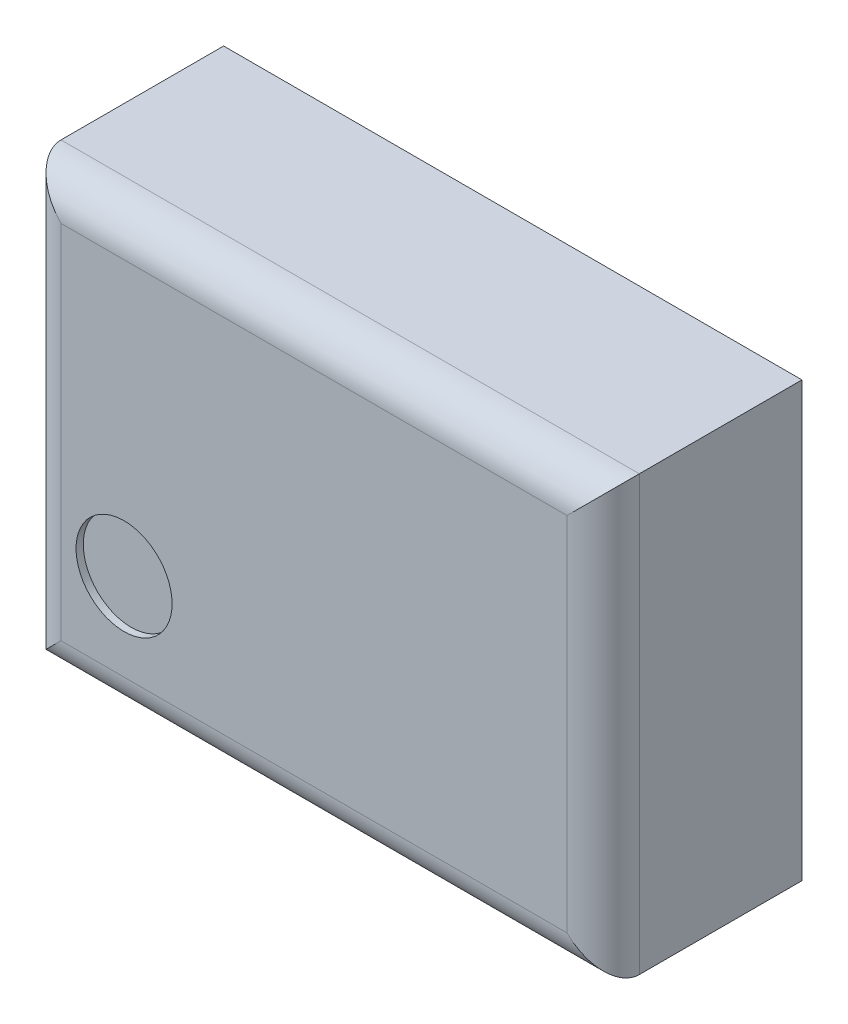
ISO-10303-21;
HEADER;
FILE_DESCRIPTION(('STEP AP214'),'2;1');
FILE_NAME('part.step','',(''),(''),'','','');
FILE_SCHEMA(('AUTOMOTIVE_DESIGN { 1 0 10303 214 1 1 1 1 }'));
ENDSEC;
DATA;
#1=APPLICATION_CONTEXT('core data for automotive mechanical design processes');
#2=APPLICATION_PROTOCOL_DEFINITION('international standard','automotive_design',2000,#1);
#3=PRODUCT_CONTEXT('',#1,'mechanical');
#4=PRODUCT('Part','Part','',(#3));
#5=PRODUCT_RELATED_PRODUCT_CATEGORY('part','',(#4));
#6=PRODUCT_DEFINITION_FORMATION('','',#4);
#7=PRODUCT_DEFINITION_CONTEXT('part definition',#1,'design');
#8=PRODUCT_DEFINITION('design','',#6,#7);
#9=PRODUCT_DEFINITION_SHAPE('','',#8);
#10=(LENGTH_UNIT() NAMED_UNIT(*) SI_UNIT(.MILLI.,.METRE.));
#11=(NAMED_UNIT(*) PLANE_ANGLE_UNIT() SI_UNIT($,.RADIAN.));
#12=(NAMED_UNIT(*) SI_UNIT($,.STERADIAN.) SOLID_ANGLE_UNIT());
#13=UNCERTAINTY_MEASURE_WITH_UNIT(LENGTH_MEASURE(1.E-05),#10,'distance_accuracy_value','');
#14=(GEOMETRIC_REPRESENTATION_CONTEXT(3) GLOBAL_UNCERTAINTY_ASSIGNED_CONTEXT((#13)) GLOBAL_UNIT_ASSIGNED_CONTEXT((#10,
#11,#12)) REPRESENTATION_CONTEXT('',''));
#15=CARTESIAN_POINT('',(0.,0.,0.));
#16=DIRECTION('',(0.,0.,1.));
#17=DIRECTION('',(1.,0.,0.));
#18=AXIS2_PLACEMENT_3D('',#15,#16,#17);
#19=CARTESIAN_POINT('',(0.,0.,0.05));
#20=DIRECTION('',(0.,0.,-1.));
#21=DIRECTION('',(-1.,0.,0.));
#22=AXIS2_PLACEMENT_3D('',#19,#20,#21);
#23=PLANE('',#22);
#24=DIRECTION('',(0.,1.,0.));
#25=VECTOR('',#24,1.);
#26=CARTESIAN_POINT('',(0.8,-0.6,0.05));
#27=LINE('',#26,#25);
#28=CARTESIAN_POINT('',(0.8,-0.6,0.05));
#29=VERTEX_POINT('',#28);
#30=CARTESIAN_POINT('',(0.8,0.6,0.05));
#31=VERTEX_POINT('',#30);
#32=EDGE_CURVE('E375',#29,#31,#27,.T.);
#33=ORIENTED_EDGE('',*,*,#32,.F.);
#34=DIRECTION('',(1.,0.,0.));
#35=VECTOR('',#34,1.);
#36=CARTESIAN_POINT('',(-0.8,-0.6,0.05));
#37=LINE('',#36,#35);
#38=CARTESIAN_POINT('',(-0.8,-0.6,0.05));
#39=VERTEX_POINT('',#38);
#40=EDGE_CURVE('E387',#39,#29,#37,.T.);
#41=ORIENTED_EDGE('',*,*,#40,.F.);
#42=DIRECTION('',(0.,-1.,0.));
#43=VECTOR('',#42,1.);
#44=CARTESIAN_POINT('',(-0.8,-0.6,0.05));
#45=LINE('',#44,#43);
#46=CARTESIAN_POINT('',(-0.8,0.6,0.05));
#47=VERTEX_POINT('',#46);
#48=EDGE_CURVE('E383',#47,#39,#45,.T.);
#49=ORIENTED_EDGE('',*,*,#48,.F.);
#50=DIRECTION('',(-1.,0.,0.));
#51=VECTOR('',#50,1.);
#52=CARTESIAN_POINT('',(-0.8,0.6,0.05));
#53=LINE('',#52,#51);
#54=EDGE_CURVE('E379',#31,#47,#53,.T.);
#55=ORIENTED_EDGE('',*,*,#54,.F.);
#56=EDGE_LOOP('',(#33,#41,#49,#55));
#57=FACE_BOUND('',#56,.T.);
#58=DIRECTION('',(0.,1.,0.));
#59=VECTOR('',#58,1.);
#60=CARTESIAN_POINT('',(-0.75,-0.55,0.05));
#61=LINE('',#60,#59);
#62=CARTESIAN_POINT('',(-0.75,-0.55,0.05));
#63=VERTEX_POINT('',#62);
#64=CARTESIAN_POINT('',(-0.75,-0.15,0.05));
#65=VERTEX_POINT('',#64);
#66=EDGE_CURVE('E371',#63,#65,#61,.T.);
#67=ORIENTED_EDGE('',*,*,#66,.F.);
#68=DIRECTION('',(-1.,0.,0.));
#69=VECTOR('',#68,1.);
#70=CARTESIAN_POINT('',(-0.75,-0.55,0.05));
#71=LINE('',#70,#69);
#72=CARTESIAN_POINT('',(-0.25,-0.55,0.05));
#73=VERTEX_POINT('',#72);
#74=EDGE_CURVE('E368',#73,#63,#71,.T.);
#75=ORIENTED_EDGE('',*,*,#74,.F.);
#76=DIRECTION('',(0.,-1.,0.));
#77=VECTOR('',#76,1.);
#78=CARTESIAN_POINT('',(-0.25,-0.55,0.05));
#79=LINE('',#78,#77);
#80=CARTESIAN_POINT('',(-0.25,-0.15,0.05));
#81=VERTEX_POINT('',#80);
#82=EDGE_CURVE('E365',#81,#73,#79,.T.);
#83=ORIENTED_EDGE('',*,*,#82,.F.);
#84=DIRECTION('',(1.,0.,0.));
#85=VECTOR('',#84,1.);
#86=CARTESIAN_POINT('',(-0.75,-0.15,0.05));
#87=LINE('',#86,#85);
#88=EDGE_CURVE('E362',#65,#81,#87,.T.);
#89=ORIENTED_EDGE('',*,*,#88,.F.);
#90=EDGE_LOOP('',(#67,#75,#83,#89));
#91=FACE_BOUND('',#90,.T.);
#92=DIRECTION('',(0.,1.,0.));
#93=VECTOR('',#92,1.);
#94=CARTESIAN_POINT('',(-0.75,0.15,0.05));
#95=LINE('',#94,#93);
#96=CARTESIAN_POINT('',(-0.75,0.15,0.05));
#97=VERTEX_POINT('',#96);
#98=CARTESIAN_POINT('',(-0.75,0.55,0.05));
#99=VERTEX_POINT('',#98);
#100=EDGE_CURVE('E282',#97,#99,#95,.T.);
#101=ORIENTED_EDGE('',*,*,#100,.F.);
#102=DIRECTION('',(-1.,0.,0.));
#103=VECTOR('',#102,1.);
#104=CARTESIAN_POINT('',(-0.75,0.15,0.05));
#105=LINE('',#104,#103);
#106=CARTESIAN_POINT('',(-0.25,0.15,0.05));
#107=VERTEX_POINT('',#106);
#108=EDGE_CURVE('E297',#107,#97,#105,.T.);
#109=ORIENTED_EDGE('',*,*,#108,.F.);
#110=DIRECTION('',(0.,-1.,0.));
#111=VECTOR('',#110,1.);
#112=CARTESIAN_POINT('',(-0.25,0.15,0.05));
#113=LINE('',#112,#111);
#114=CARTESIAN_POINT('',(-0.25,0.55,0.05));
#115=VERTEX_POINT('',#114);
#116=EDGE_CURVE('E300',#115,#107,#113,.T.);
#117=ORIENTED_EDGE('',*,*,#116,.F.);
#118=DIRECTION('',(1.,0.,0.));
#119=VECTOR('',#118,1.);
#120=CARTESIAN_POINT('',(-0.75,0.55,0.05));
#121=LINE('',#120,#119);
#122=EDGE_CURVE('E303',#99,#115,#121,.T.);
#123=ORIENTED_EDGE('',*,*,#122,.F.);
#124=EDGE_LOOP('',(#101,#109,#117,#123));
#125=FACE_BOUND('',#124,.T.);
#126=DIRECTION('',(0.,1.,0.));
#127=VECTOR('',#126,1.);
#128=CARTESIAN_POINT('',(0.25,0.15,0.05));
#129=LINE('',#128,#127);
#130=CARTESIAN_POINT('',(0.25,0.15,0.05));
#131=VERTEX_POINT('',#130);
#132=CARTESIAN_POINT('',(0.25,0.55,0.05));
#133=VERTEX_POINT('',#132);
#134=EDGE_CURVE('E242',#131,#133,#129,.T.);
#135=ORIENTED_EDGE('',*,*,#134,.F.);
#136=DIRECTION('',(-1.,0.,0.));
#137=VECTOR('',#136,1.);
#138=CARTESIAN_POINT('',(0.25,0.15,0.05));
#139=LINE('',#138,#137);
#140=CARTESIAN_POINT('',(0.75,0.15,0.05));
#141=VERTEX_POINT('',#140);
#142=EDGE_CURVE('E256',#141,#131,#139,.T.);
#143=ORIENTED_EDGE('',*,*,#142,.F.);
#144=DIRECTION('',(0.,-1.,0.));
#145=VECTOR('',#144,1.);
#146=CARTESIAN_POINT('',(0.75,0.15,0.05));
#147=LINE('',#146,#145);
#148=CARTESIAN_POINT('',(0.75,0.55,0.05));
#149=VERTEX_POINT('',#148);
#150=EDGE_CURVE('E259',#149,#141,#147,.T.);
#151=ORIENTED_EDGE('',*,*,#150,.F.);
#152=DIRECTION('',(1.,0.,0.));
#153=VECTOR('',#152,1.);
#154=CARTESIAN_POINT('',(0.25,0.55,0.05));
#155=LINE('',#154,#153);
#156=EDGE_CURVE('E262',#133,#149,#155,.T.);
#157=ORIENTED_EDGE('',*,*,#156,.F.);
#158=EDGE_LOOP('',(#135,#143,#151,#157));
#159=FACE_BOUND('',#158,.T.);
#160=DIRECTION('',(0.,1.,0.));
#161=VECTOR('',#160,1.);
#162=CARTESIAN_POINT('',(0.25,-0.55,0.05));
#163=LINE('',#162,#161);
#164=CARTESIAN_POINT('',(0.25,-0.55,0.05));
#165=VERTEX_POINT('',#164);
#166=CARTESIAN_POINT('',(0.25,-0.15,0.05));
#167=VERTEX_POINT('',#166);
#168=EDGE_CURVE('E206',#165,#167,#163,.T.);
#169=ORIENTED_EDGE('',*,*,#168,.F.);
#170=DIRECTION('',(-1.,0.,0.));
#171=VECTOR('',#170,1.);
#172=CARTESIAN_POINT('',(0.25,-0.55,0.05));
#173=LINE('',#172,#171);
#174=CARTESIAN_POINT('',(0.75,-0.55,0.05));
#175=VERTEX_POINT('',#174);
#176=EDGE_CURVE('E194',#175,#165,#173,.T.);
#177=ORIENTED_EDGE('',*,*,#176,.F.);
#178=DIRECTION('',(0.,-1.,0.));
#179=VECTOR('',#178,1.);
#180=CARTESIAN_POINT('',(0.75,-0.55,0.05));
#181=LINE('',#180,#179);
#182=CARTESIAN_POINT('',(0.75,-0.15,0.05));
#183=VERTEX_POINT('',#182);
#184=EDGE_CURVE('E205',#183,#175,#181,.T.);
#185=ORIENTED_EDGE('',*,*,#184,.F.);
#186=DIRECTION('',(1.,0.,0.));
#187=VECTOR('',#186,1.);
#188=CARTESIAN_POINT('',(0.25,-0.15,0.05));
#189=LINE('',#188,#187);
#190=EDGE_CURVE('E216',#167,#183,#189,.T.);
#191=ORIENTED_EDGE('',*,*,#190,.F.);
#192=EDGE_LOOP('',(#169,#177,#185,#191));
#193=FACE_BOUND('',#192,.T.);
#194=ADVANCED_FACE('F43',(#57,#91,#125,#159,#193),#23,.T.);
#195=CARTESIAN_POINT('',(0.8,-0.6,0.6));
#196=DIRECTION('',(-1.,0.,0.));
#197=DIRECTION('',(0.,0.,1.));
#198=AXIS2_PLACEMENT_3D('',#195,#196,#197);
#199=PLANE('',#198);
#200=DIRECTION('',(0.,0.,-1.));
#201=VECTOR('',#200,1.);
#202=CARTESIAN_POINT('',(0.8,0.6,0.6));
#203=LINE('',#202,#201);
#204=CARTESIAN_POINT('',(0.8,0.6,0.5));
#205=VERTEX_POINT('',#204);
#206=EDGE_CURVE('E400',#205,#31,#203,.T.);
#207=ORIENTED_EDGE('',*,*,#206,.F.);
#208=DIRECTION('',(0.,1.,0.));
#209=VECTOR('',#208,1.);
#210=CARTESIAN_POINT('',(0.8,-0.6,0.5));
#211=LINE('',#210,#209);
#212=CARTESIAN_POINT('',(0.8,-0.6,0.5));
#213=VERTEX_POINT('',#212);
#214=EDGE_CURVE('E11',#205,#213,#211,.F.);
#215=ORIENTED_EDGE('',*,*,#214,.T.);
#216=DIRECTION('',(0.,0.,-1.));
#217=VECTOR('',#216,1.);
#218=CARTESIAN_POINT('',(0.8,-0.6,0.6));
#219=LINE('',#218,#217);
#220=EDGE_CURVE('E391',#213,#29,#219,.T.);
#221=ORIENTED_EDGE('',*,*,#220,.T.);
#222=ORIENTED_EDGE('',*,*,#32,.T.);
#223=EDGE_LOOP('',(#207,#215,#221,#222));
#224=FACE_BOUND('',#223,.T.);
#225=ADVANCED_FACE('F460',(#224),#199,.F.);
#226=CARTESIAN_POINT('',(-0.8,0.6,0.6));
#227=DIRECTION('',(0.,-1.,0.));
#228=DIRECTION('',(0.,0.,-1.));
#229=AXIS2_PLACEMENT_3D('',#226,#227,#228);
#230=PLANE('',#229);
#231=DIRECTION('',(0.,0.,-1.));
#232=VECTOR('',#231,1.);
#233=CARTESIAN_POINT('',(-0.8,0.6,0.6));
#234=LINE('',#233,#232);
#235=CARTESIAN_POINT('',(-0.8,0.6,0.5));
#236=VERTEX_POINT('',#235);
#237=EDGE_CURVE('E397',#236,#47,#234,.T.);
#238=ORIENTED_EDGE('',*,*,#237,.F.);
#239=DIRECTION('',(-1.,0.,0.));
#240=VECTOR('',#239,1.);
#241=CARTESIAN_POINT('',(-0.8,0.6,0.5));
#242=LINE('',#241,#240);
#243=EDGE_CURVE('E53',#236,#205,#242,.F.);
#244=ORIENTED_EDGE('',*,*,#243,.T.);
#245=ORIENTED_EDGE('',*,*,#206,.T.);
#246=ORIENTED_EDGE('',*,*,#54,.T.);
#247=EDGE_LOOP('',(#238,#244,#245,#246));
#248=FACE_BOUND('',#247,.T.);
#249=ADVANCED_FACE('F461',(#248),#230,.F.);
#250=CARTESIAN_POINT('',(-0.8,-0.6,0.6));
#251=DIRECTION('',(1.,0.,0.));
#252=DIRECTION('',(0.,0.,-1.));
#253=AXIS2_PLACEMENT_3D('',#250,#251,#252);
#254=PLANE('',#253);
#255=DIRECTION('',(0.,0.,-1.));
#256=VECTOR('',#255,1.);
#257=CARTESIAN_POINT('',(-0.8,-0.6,0.6));
#258=LINE('',#257,#256);
#259=CARTESIAN_POINT('',(-0.8,-0.6,0.5));
#260=VERTEX_POINT('',#259);
#261=EDGE_CURVE('E394',#260,#39,#258,.T.);
#262=ORIENTED_EDGE('',*,*,#261,.F.);
#263=DIRECTION('',(0.,-1.,0.));
#264=VECTOR('',#263,1.);
#265=CARTESIAN_POINT('',(-0.8,-0.6,0.5));
#266=LINE('',#265,#264);
#267=EDGE_CURVE('E68',#260,#236,#266,.F.);
#268=ORIENTED_EDGE('',*,*,#267,.T.);
#269=ORIENTED_EDGE('',*,*,#237,.T.);
#270=ORIENTED_EDGE('',*,*,#48,.T.);
#271=EDGE_LOOP('',(#262,#268,#269,#270));
#272=FACE_BOUND('',#271,.T.);
#273=ADVANCED_FACE('F452',(#272),#254,.F.);
#274=CARTESIAN_POINT('',(-0.8,-0.6,0.6));
#275=DIRECTION('',(0.,1.,0.));
#276=DIRECTION('',(0.,0.,1.));
#277=AXIS2_PLACEMENT_3D('',#274,#275,#276);
#278=PLANE('',#277);
#279=ORIENTED_EDGE('',*,*,#220,.F.);
#280=DIRECTION('',(1.,0.,0.));
#281=VECTOR('',#280,1.);
#282=CARTESIAN_POINT('',(-0.8,-0.6,0.5));
#283=LINE('',#282,#281);
#284=EDGE_CURVE('E416',#213,#260,#283,.F.);
#285=ORIENTED_EDGE('',*,*,#284,.T.);
#286=ORIENTED_EDGE('',*,*,#261,.T.);
#287=ORIENTED_EDGE('',*,*,#40,.T.);
#288=EDGE_LOOP('',(#279,#285,#286,#287));
#289=FACE_BOUND('',#288,.T.);
#290=ADVANCED_FACE('F451',(#289),#278,.F.);
#291=CARTESIAN_POINT('',(0.,0.,0.6));
#292=DIRECTION('',(0.,0.,-1.));
#293=DIRECTION('',(-1.,0.,0.));
#294=AXIS2_PLACEMENT_3D('',#291,#292,#293);
#295=PLANE('',#294);
#296=CARTESIAN_POINT('',(-0.525466390564944,-0.258003208926993,0.6));
#297=DIRECTION('',(0.,0.,1.));
#298=DIRECTION('',(1.,0.,0.));
#299=AXIS2_PLACEMENT_3D('',#296,#297,#298);
#300=CIRCLE('',#299,0.132827506627821);
#301=CARTESIAN_POINT('',(-0.392638883937123,-0.258003208926993,0.6));
#302=VERTEX_POINT('',#301);
#303=EDGE_CURVE('E224',#302,#302,#300,.T.);
#304=ORIENTED_EDGE('',*,*,#303,.F.);
#305=EDGE_LOOP('',(#304));
#306=FACE_BOUND('',#305,.T.);
#307=DIRECTION('',(0.,-1.,0.));
#308=VECTOR('',#307,1.);
#309=CARTESIAN_POINT('',(-0.7,0.,0.6));
#310=LINE('',#309,#308);
#311=CARTESIAN_POINT('',(-0.7,0.5,0.6));
#312=VERTEX_POINT('',#311);
#313=CARTESIAN_POINT('',(-0.7,-0.5,0.6));
#314=VERTEX_POINT('',#313);
#315=EDGE_CURVE('E409',#312,#314,#310,.T.);
#316=ORIENTED_EDGE('',*,*,#315,.T.);
#317=DIRECTION('',(1.,0.,0.));
#318=VECTOR('',#317,1.);
#319=CARTESIAN_POINT('',(0.,-0.5,0.6));
#320=LINE('',#319,#318);
#321=CARTESIAN_POINT('',(0.7,-0.5,0.6));
#322=VERTEX_POINT('',#321);
#323=EDGE_CURVE('E412',#314,#322,#320,.T.);
#324=ORIENTED_EDGE('',*,*,#323,.T.);
#325=DIRECTION('',(0.,1.,0.));
#326=VECTOR('',#325,1.);
#327=CARTESIAN_POINT('',(0.7,0.,0.6));
#328=LINE('',#327,#326);
#329=CARTESIAN_POINT('',(0.7,0.5,0.6));
#330=VERTEX_POINT('',#329);
#331=EDGE_CURVE('E403',#322,#330,#328,.T.);
#332=ORIENTED_EDGE('',*,*,#331,.T.);
#333=DIRECTION('',(-1.,0.,0.));
#334=VECTOR('',#333,1.);
#335=CARTESIAN_POINT('',(0.,0.5,0.6));
#336=LINE('',#335,#334);
#337=EDGE_CURVE('E406',#330,#312,#336,.T.);
#338=ORIENTED_EDGE('',*,*,#337,.T.);
#339=EDGE_LOOP('',(#316,#324,#332,#338));
#340=FACE_BOUND('',#339,.T.);
#341=ADVANCED_FACE('F443',(#306,#340),#295,.F.);
#342=CARTESIAN_POINT('',(-0.75,-0.55,0.602));
#343=DIRECTION('',(0.,1.,0.));
#344=DIRECTION('',(0.,0.,1.));
#345=AXIS2_PLACEMENT_3D('',#342,#343,#344);
#346=PLANE('',#345);
#347=DIRECTION('',(0.,0.,-1.));
#348=VECTOR('',#347,1.);
#349=CARTESIAN_POINT('',(-0.25,-0.55,0.602));
#350=LINE('',#349,#348);
#351=CARTESIAN_POINT('',(-0.25,-0.55,0.));
#352=VERTEX_POINT('',#351);
#353=EDGE_CURVE('E356',#73,#352,#350,.T.);
#354=ORIENTED_EDGE('',*,*,#353,.F.);
#355=ORIENTED_EDGE('',*,*,#74,.T.);
#356=DIRECTION('',(0.,0.,-1.));
#357=VECTOR('',#356,1.);
#358=CARTESIAN_POINT('',(-0.75,-0.55,0.602));
#359=LINE('',#358,#357);
#360=CARTESIAN_POINT('',(-0.75,-0.55,0.));
#361=VERTEX_POINT('',#360);
#362=EDGE_CURVE('E359',#63,#361,#359,.T.);
#363=ORIENTED_EDGE('',*,*,#362,.T.);
#364=DIRECTION('',(1.,0.,0.));
#365=VECTOR('',#364,1.);
#366=CARTESIAN_POINT('',(-0.75,-0.55,0.));
#367=LINE('',#366,#365);
#368=EDGE_CURVE('E335',#361,#352,#367,.T.);
#369=ORIENTED_EDGE('',*,*,#368,.T.);
#370=EDGE_LOOP('',(#354,#355,#363,#369));
#371=FACE_BOUND('',#370,.T.);
#372=ADVANCED_FACE('F481',(#371),#346,.F.);
#373=CARTESIAN_POINT('',(0.,0.,0.));
#374=DIRECTION('',(0.,0.,-1.));
#375=DIRECTION('',(-1.,0.,0.));
#376=AXIS2_PLACEMENT_3D('',#373,#374,#375);
#377=PLANE('',#376);
#378=DIRECTION('',(0.,-1.,0.));
#379=VECTOR('',#378,1.);
#380=CARTESIAN_POINT('',(-0.75,-0.55,0.));
#381=LINE('',#380,#379);
#382=CARTESIAN_POINT('',(-0.75,-0.15,0.));
#383=VERTEX_POINT('',#382);
#384=EDGE_CURVE('E323',#383,#361,#381,.T.);
#385=ORIENTED_EDGE('',*,*,#384,.F.);
#386=DIRECTION('',(-1.,0.,0.));
#387=VECTOR('',#386,1.);
#388=CARTESIAN_POINT('',(-0.75,-0.15,0.));
#389=LINE('',#388,#387);
#390=CARTESIAN_POINT('',(-0.25,-0.15,0.));
#391=VERTEX_POINT('',#390);
#392=EDGE_CURVE('E344',#391,#383,#389,.T.);
#393=ORIENTED_EDGE('',*,*,#392,.F.);
#394=DIRECTION('',(0.,1.,0.));
#395=VECTOR('',#394,1.);
#396=CARTESIAN_POINT('',(-0.25,-0.55,0.));
#397=LINE('',#396,#395);
#398=EDGE_CURVE('E340',#352,#391,#397,.T.);
#399=ORIENTED_EDGE('',*,*,#398,.F.);
#400=ORIENTED_EDGE('',*,*,#368,.F.);
#401=EDGE_LOOP('',(#385,#393,#399,#400));
#402=FACE_BOUND('',#401,.T.);
#403=ADVANCED_FACE('F487',(#402),#377,.T.);
#404=CARTESIAN_POINT('',(-0.25,-0.55,0.602));
#405=DIRECTION('',(-1.,0.,0.));
#406=DIRECTION('',(0.,0.,1.));
#407=AXIS2_PLACEMENT_3D('',#404,#405,#406);
#408=PLANE('',#407);
#409=DIRECTION('',(0.,0.,-1.));
#410=VECTOR('',#409,1.);
#411=CARTESIAN_POINT('',(-0.25,-0.15,0.602));
#412=LINE('',#411,#410);
#413=EDGE_CURVE('E353',#81,#391,#412,.T.);
#414=ORIENTED_EDGE('',*,*,#413,.F.);
#415=ORIENTED_EDGE('',*,*,#82,.T.);
#416=ORIENTED_EDGE('',*,*,#353,.T.);
#417=ORIENTED_EDGE('',*,*,#398,.T.);
#418=EDGE_LOOP('',(#414,#415,#416,#417));
#419=FACE_BOUND('',#418,.T.);
#420=ADVANCED_FACE('F505',(#419),#408,.F.);
#421=CARTESIAN_POINT('',(-0.75,-0.55,0.602));
#422=DIRECTION('',(1.,0.,0.));
#423=DIRECTION('',(0.,0.,-1.));
#424=AXIS2_PLACEMENT_3D('',#421,#422,#423);
#425=PLANE('',#424);
#426=ORIENTED_EDGE('',*,*,#362,.F.);
#427=ORIENTED_EDGE('',*,*,#66,.T.);
#428=DIRECTION('',(0.,0.,-1.));
#429=VECTOR('',#428,1.);
#430=CARTESIAN_POINT('',(-0.75,-0.15,0.602));
#431=LINE('',#430,#429);
#432=EDGE_CURVE('E339',#65,#383,#431,.T.);
#433=ORIENTED_EDGE('',*,*,#432,.T.);
#434=ORIENTED_EDGE('',*,*,#384,.T.);
#435=EDGE_LOOP('',(#426,#427,#433,#434));
#436=FACE_BOUND('',#435,.T.);
#437=ADVANCED_FACE('F494',(#436),#425,.F.);
#438=CARTESIAN_POINT('',(-0.75,-0.15,0.602));
#439=DIRECTION('',(0.,-1.,0.));
#440=DIRECTION('',(1.,0.,0.));
#441=AXIS2_PLACEMENT_3D('',#438,#439,#440);
#442=PLANE('',#441);
#443=ORIENTED_EDGE('',*,*,#432,.F.);
#444=ORIENTED_EDGE('',*,*,#88,.T.);
#445=ORIENTED_EDGE('',*,*,#413,.T.);
#446=ORIENTED_EDGE('',*,*,#392,.T.);
#447=EDGE_LOOP('',(#443,#444,#445,#446));
#448=FACE_BOUND('',#447,.T.);
#449=ADVANCED_FACE('F483',(#448),#442,.F.);
#450=CARTESIAN_POINT('',(-0.75,0.15,0.602));
#451=DIRECTION('',(0.,1.,0.));
#452=DIRECTION('',(0.,0.,1.));
#453=AXIS2_PLACEMENT_3D('',#450,#451,#452);
#454=PLANE('',#453);
#455=DIRECTION('',(0.,0.,-1.));
#456=VECTOR('',#455,1.);
#457=CARTESIAN_POINT('',(-0.25,0.15,0.602));
#458=LINE('',#457,#456);
#459=CARTESIAN_POINT('',(-0.25,0.15,0.));
#460=VERTEX_POINT('',#459);
#461=EDGE_CURVE('E309',#107,#460,#458,.T.);
#462=ORIENTED_EDGE('',*,*,#461,.F.);
#463=ORIENTED_EDGE('',*,*,#108,.T.);
#464=DIRECTION('',(0.,0.,-1.));
#465=VECTOR('',#464,1.);
#466=CARTESIAN_POINT('',(-0.75,0.15,0.602));
#467=LINE('',#466,#465);
#468=CARTESIAN_POINT('',(-0.75,0.15,0.));
#469=VERTEX_POINT('',#468);
#470=EDGE_CURVE('E306',#97,#469,#467,.T.);
#471=ORIENTED_EDGE('',*,*,#470,.T.);
#472=DIRECTION('',(1.,0.,0.));
#473=VECTOR('',#472,1.);
#474=CARTESIAN_POINT('',(-0.75,0.15,0.));
#475=LINE('',#474,#473);
#476=EDGE_CURVE('E318',#469,#460,#475,.T.);
#477=ORIENTED_EDGE('',*,*,#476,.T.);
#478=EDGE_LOOP('',(#462,#463,#471,#477));
#479=FACE_BOUND('',#478,.T.);
#480=ADVANCED_FACE('F493',(#479),#454,.F.);
#481=CARTESIAN_POINT('',(0.,0.,0.));
#482=DIRECTION('',(0.,0.,-1.));
#483=DIRECTION('',(-1.,0.,0.));
#484=AXIS2_PLACEMENT_3D('',#481,#482,#483);
#485=PLANE('',#484);
#486=DIRECTION('',(0.,-1.,0.));
#487=VECTOR('',#486,1.);
#488=CARTESIAN_POINT('',(-0.75,0.15,0.));
#489=LINE('',#488,#487);
#490=CARTESIAN_POINT('',(-0.75,0.55,0.));
#491=VERTEX_POINT('',#490);
#492=EDGE_CURVE('E319',#491,#469,#489,.T.);
#493=ORIENTED_EDGE('',*,*,#492,.F.);
#494=DIRECTION('',(-1.,0.,0.));
#495=VECTOR('',#494,1.);
#496=CARTESIAN_POINT('',(-0.75,0.55,0.));
#497=LINE('',#496,#495);
#498=CARTESIAN_POINT('',(-0.25,0.55,0.));
#499=VERTEX_POINT('',#498);
#500=EDGE_CURVE('E324',#499,#491,#497,.T.);
#501=ORIENTED_EDGE('',*,*,#500,.F.);
#502=DIRECTION('',(0.,1.,0.));
#503=VECTOR('',#502,1.);
#504=CARTESIAN_POINT('',(-0.25,0.15,0.));
#505=LINE('',#504,#503);
#506=EDGE_CURVE('E328',#460,#499,#505,.T.);
#507=ORIENTED_EDGE('',*,*,#506,.F.);
#508=ORIENTED_EDGE('',*,*,#476,.F.);
#509=EDGE_LOOP('',(#493,#501,#507,#508));
#510=FACE_BOUND('',#509,.T.);
#511=ADVANCED_FACE('F501',(#510),#485,.T.);
#512=CARTESIAN_POINT('',(-0.25,0.15,0.602));
#513=DIRECTION('',(-1.,0.,0.));
#514=DIRECTION('',(0.,0.,1.));
#515=AXIS2_PLACEMENT_3D('',#512,#513,#514);
#516=PLANE('',#515);
#517=DIRECTION('',(0.,0.,-1.));
#518=VECTOR('',#517,1.);
#519=CARTESIAN_POINT('',(-0.25,0.55,0.602));
#520=LINE('',#519,#518);
#521=EDGE_CURVE('E312',#115,#499,#520,.T.);
#522=ORIENTED_EDGE('',*,*,#521,.F.);
#523=ORIENTED_EDGE('',*,*,#116,.T.);
#524=ORIENTED_EDGE('',*,*,#461,.T.);
#525=ORIENTED_EDGE('',*,*,#506,.T.);
#526=EDGE_LOOP('',(#522,#523,#524,#525));
#527=FACE_BOUND('',#526,.T.);
#528=ADVANCED_FACE('F515',(#527),#516,.F.);
#529=CARTESIAN_POINT('',(-0.75,0.15,0.602));
#530=DIRECTION('',(1.,0.,0.));
#531=DIRECTION('',(0.,0.,-1.));
#532=AXIS2_PLACEMENT_3D('',#529,#530,#531);
#533=PLANE('',#532);
#534=ORIENTED_EDGE('',*,*,#470,.F.);
#535=ORIENTED_EDGE('',*,*,#100,.T.);
#536=DIRECTION('',(0.,0.,-1.));
#537=VECTOR('',#536,1.);
#538=CARTESIAN_POINT('',(-0.75,0.55,0.602));
#539=LINE('',#538,#537);
#540=EDGE_CURVE('E315',#99,#491,#539,.T.);
#541=ORIENTED_EDGE('',*,*,#540,.T.);
#542=ORIENTED_EDGE('',*,*,#492,.T.);
#543=EDGE_LOOP('',(#534,#535,#541,#542));
#544=FACE_BOUND('',#543,.T.);
#545=ADVANCED_FACE('F520',(#544),#533,.F.);
#546=CARTESIAN_POINT('',(-0.75,0.55,0.602));
#547=DIRECTION('',(0.,-1.,0.));
#548=DIRECTION('',(1.,0.,0.));
#549=AXIS2_PLACEMENT_3D('',#546,#547,#548);
#550=PLANE('',#549);
#551=ORIENTED_EDGE('',*,*,#540,.F.);
#552=ORIENTED_EDGE('',*,*,#122,.T.);
#553=ORIENTED_EDGE('',*,*,#521,.T.);
#554=ORIENTED_EDGE('',*,*,#500,.T.);
#555=EDGE_LOOP('',(#551,#552,#553,#554));
#556=FACE_BOUND('',#555,.T.);
#557=ADVANCED_FACE('F490',(#556),#550,.F.);
#558=CARTESIAN_POINT('',(0.25,0.15,0.602));
#559=DIRECTION('',(0.,1.,0.));
#560=DIRECTION('',(0.,0.,1.));
#561=AXIS2_PLACEMENT_3D('',#558,#559,#560);
#562=PLANE('',#561);
#563=DIRECTION('',(0.,0.,-1.));
#564=VECTOR('',#563,1.);
#565=CARTESIAN_POINT('',(0.75,0.15,0.602));
#566=LINE('',#565,#564);
#567=CARTESIAN_POINT('',(0.75,0.15,0.));
#568=VERTEX_POINT('',#567);
#569=EDGE_CURVE('E268',#141,#568,#566,.T.);
#570=ORIENTED_EDGE('',*,*,#569,.F.);
#571=ORIENTED_EDGE('',*,*,#142,.T.);
#572=DIRECTION('',(0.,0.,-1.));
#573=VECTOR('',#572,1.);
#574=CARTESIAN_POINT('',(0.25,0.15,0.602));
#575=LINE('',#574,#573);
#576=CARTESIAN_POINT('',(0.25,0.15,0.));
#577=VERTEX_POINT('',#576);
#578=EDGE_CURVE('E265',#131,#577,#575,.T.);
#579=ORIENTED_EDGE('',*,*,#578,.T.);
#580=DIRECTION('',(1.,0.,0.));
#581=VECTOR('',#580,1.);
#582=CARTESIAN_POINT('',(0.25,0.15,0.));
#583=LINE('',#582,#581);
#584=EDGE_CURVE('E277',#577,#568,#583,.T.);
#585=ORIENTED_EDGE('',*,*,#584,.T.);
#586=EDGE_LOOP('',(#570,#571,#579,#585));
#587=FACE_BOUND('',#586,.T.);
#588=ADVANCED_FACE('F524',(#587),#562,.F.);
#589=CARTESIAN_POINT('',(0.,0.,0.));
#590=DIRECTION('',(0.,0.,-1.));
#591=DIRECTION('',(-1.,0.,0.));
#592=AXIS2_PLACEMENT_3D('',#589,#590,#591);
#593=PLANE('',#592);
#594=DIRECTION('',(0.,-1.,0.));
#595=VECTOR('',#594,1.);
#596=CARTESIAN_POINT('',(0.25,0.15,0.));
#597=LINE('',#596,#595);
#598=CARTESIAN_POINT('',(0.25,0.55,0.));
#599=VERTEX_POINT('',#598);
#600=EDGE_CURVE('E278',#599,#577,#597,.T.);
#601=ORIENTED_EDGE('',*,*,#600,.F.);
#602=DIRECTION('',(-1.,0.,0.));
#603=VECTOR('',#602,1.);
#604=CARTESIAN_POINT('',(0.25,0.55,0.));
#605=LINE('',#604,#603);
#606=CARTESIAN_POINT('',(0.75,0.55,0.));
#607=VERTEX_POINT('',#606);
#608=EDGE_CURVE('E283',#607,#599,#605,.T.);
#609=ORIENTED_EDGE('',*,*,#608,.F.);
#610=DIRECTION('',(0.,1.,0.));
#611=VECTOR('',#610,1.);
#612=CARTESIAN_POINT('',(0.75,0.15,0.));
#613=LINE('',#612,#611);
#614=EDGE_CURVE('E287',#568,#607,#613,.T.);
#615=ORIENTED_EDGE('',*,*,#614,.F.);
#616=ORIENTED_EDGE('',*,*,#584,.F.);
#617=EDGE_LOOP('',(#601,#609,#615,#616));
#618=FACE_BOUND('',#617,.T.);
#619=ADVANCED_FACE('F529',(#618),#593,.T.);
#620=CARTESIAN_POINT('',(0.75,0.15,0.602));
#621=DIRECTION('',(-1.,0.,0.));
#622=DIRECTION('',(0.,-1.,0.));
#623=AXIS2_PLACEMENT_3D('',#620,#621,#622);
#624=PLANE('',#623);
#625=DIRECTION('',(0.,0.,-1.));
#626=VECTOR('',#625,1.);
#627=CARTESIAN_POINT('',(0.75,0.55,0.602));
#628=LINE('',#627,#626);
#629=EDGE_CURVE('E271',#149,#607,#628,.T.);
#630=ORIENTED_EDGE('',*,*,#629,.F.);
#631=ORIENTED_EDGE('',*,*,#150,.T.);
#632=ORIENTED_EDGE('',*,*,#569,.T.);
#633=ORIENTED_EDGE('',*,*,#614,.T.);
#634=EDGE_LOOP('',(#630,#631,#632,#633));
#635=FACE_BOUND('',#634,.T.);
#636=ADVANCED_FACE('F532',(#635),#624,.F.);
#637=CARTESIAN_POINT('',(0.25,0.15,0.602));
#638=DIRECTION('',(1.,0.,0.));
#639=DIRECTION('',(0.,0.,-1.));
#640=AXIS2_PLACEMENT_3D('',#637,#638,#639);
#641=PLANE('',#640);
#642=ORIENTED_EDGE('',*,*,#578,.F.);
#643=ORIENTED_EDGE('',*,*,#134,.T.);
#644=DIRECTION('',(0.,0.,-1.));
#645=VECTOR('',#644,1.);
#646=CARTESIAN_POINT('',(0.25,0.55,0.602));
#647=LINE('',#646,#645);
#648=EDGE_CURVE('E274',#133,#599,#647,.T.);
#649=ORIENTED_EDGE('',*,*,#648,.T.);
#650=ORIENTED_EDGE('',*,*,#600,.T.);
#651=EDGE_LOOP('',(#642,#643,#649,#650));
#652=FACE_BOUND('',#651,.T.);
#653=ADVANCED_FACE('F540',(#652),#641,.F.);
#654=CARTESIAN_POINT('',(0.25,0.55,0.602));
#655=DIRECTION('',(0.,-1.,0.));
#656=DIRECTION('',(0.,0.,-1.));
#657=AXIS2_PLACEMENT_3D('',#654,#655,#656);
#658=PLANE('',#657);
#659=ORIENTED_EDGE('',*,*,#648,.F.);
#660=ORIENTED_EDGE('',*,*,#156,.T.);
#661=ORIENTED_EDGE('',*,*,#629,.T.);
#662=ORIENTED_EDGE('',*,*,#608,.T.);
#663=EDGE_LOOP('',(#659,#660,#661,#662));
#664=FACE_BOUND('',#663,.T.);
#665=ADVANCED_FACE('F504',(#664),#658,.F.);
#666=CARTESIAN_POINT('',(0.25,-0.55,0.602));
#667=DIRECTION('',(0.,1.,0.));
#668=DIRECTION('',(0.,0.,1.));
#669=AXIS2_PLACEMENT_3D('',#666,#667,#668);
#670=PLANE('',#669);
#671=DIRECTION('',(0.,0.,-1.));
#672=VECTOR('',#671,1.);
#673=CARTESIAN_POINT('',(0.75,-0.55,0.602));
#674=LINE('',#673,#672);
#675=CARTESIAN_POINT('',(0.75,-0.55,0.));
#676=VERTEX_POINT('',#675);
#677=EDGE_CURVE('E200',#175,#676,#674,.T.);
#678=ORIENTED_EDGE('',*,*,#677,.F.);
#679=ORIENTED_EDGE('',*,*,#176,.T.);
#680=DIRECTION('',(0.,0.,-1.));
#681=VECTOR('',#680,1.);
#682=CARTESIAN_POINT('',(0.25,-0.55,0.602));
#683=LINE('',#682,#681);
#684=CARTESIAN_POINT('',(0.25,-0.55,0.));
#685=VERTEX_POINT('',#684);
#686=EDGE_CURVE('E198',#165,#685,#683,.T.);
#687=ORIENTED_EDGE('',*,*,#686,.T.);
#688=DIRECTION('',(1.,0.,0.));
#689=VECTOR('',#688,1.);
#690=CARTESIAN_POINT('',(0.25,-0.55,0.));
#691=LINE('',#690,#689);
#692=EDGE_CURVE('E239',#685,#676,#691,.T.);
#693=ORIENTED_EDGE('',*,*,#692,.T.);
#694=EDGE_LOOP('',(#678,#679,#687,#693));
#695=FACE_BOUND('',#694,.T.);
#696=ADVANCED_FACE('F196',(#695),#670,.F.);
#697=CARTESIAN_POINT('',(0.,0.,0.));
#698=DIRECTION('',(0.,0.,-1.));
#699=DIRECTION('',(-1.,0.,0.));
#700=AXIS2_PLACEMENT_3D('',#697,#698,#699);
#701=PLANE('',#700);
#702=DIRECTION('',(0.,-1.,0.));
#703=VECTOR('',#702,1.);
#704=CARTESIAN_POINT('',(0.25,-0.55,0.));
#705=LINE('',#704,#703);
#706=CARTESIAN_POINT('',(0.25,-0.15,0.));
#707=VERTEX_POINT('',#706);
#708=EDGE_CURVE('E214',#707,#685,#705,.T.);
#709=ORIENTED_EDGE('',*,*,#708,.F.);
#710=DIRECTION('',(-1.,0.,0.));
#711=VECTOR('',#710,1.);
#712=CARTESIAN_POINT('',(0.25,-0.15,0.));
#713=LINE('',#712,#711);
#714=CARTESIAN_POINT('',(0.75,-0.15,0.));
#715=VERTEX_POINT('',#714);
#716=EDGE_CURVE('E243',#715,#707,#713,.T.);
#717=ORIENTED_EDGE('',*,*,#716,.F.);
#718=DIRECTION('',(0.,1.,0.));
#719=VECTOR('',#718,1.);
#720=CARTESIAN_POINT('',(0.75,-0.55,0.));
#721=LINE('',#720,#719);
#722=EDGE_CURVE('E247',#676,#715,#721,.T.);
#723=ORIENTED_EDGE('',*,*,#722,.F.);
#724=ORIENTED_EDGE('',*,*,#692,.F.);
#725=EDGE_LOOP('',(#709,#717,#723,#724));
#726=FACE_BOUND('',#725,.T.);
#727=ADVANCED_FACE('F548',(#726),#701,.T.);
#728=CARTESIAN_POINT('',(0.75,-0.55,0.602));
#729=DIRECTION('',(-1.,0.,0.));
#730=DIRECTION('',(0.,0.,1.));
#731=AXIS2_PLACEMENT_3D('',#728,#729,#730);
#732=PLANE('',#731);
#733=DIRECTION('',(0.,0.,-1.));
#734=VECTOR('',#733,1.);
#735=CARTESIAN_POINT('',(0.75,-0.15,0.602));
#736=LINE('',#735,#734);
#737=EDGE_CURVE('E233',#183,#715,#736,.T.);
#738=ORIENTED_EDGE('',*,*,#737,.F.);
#739=ORIENTED_EDGE('',*,*,#184,.T.);
#740=ORIENTED_EDGE('',*,*,#677,.T.);
#741=ORIENTED_EDGE('',*,*,#722,.T.);
#742=EDGE_LOOP('',(#738,#739,#740,#741));
#743=FACE_BOUND('',#742,.T.);
#744=ADVANCED_FACE('F551',(#743),#732,.F.);
#745=CARTESIAN_POINT('',(0.25,-0.55,0.602));
#746=DIRECTION('',(1.,0.,0.));
#747=DIRECTION('',(0.,0.,-1.));
#748=AXIS2_PLACEMENT_3D('',#745,#746,#747);
#749=PLANE('',#748);
#750=ORIENTED_EDGE('',*,*,#686,.F.);
#751=ORIENTED_EDGE('',*,*,#168,.T.);
#752=DIRECTION('',(0.,0.,-1.));
#753=VECTOR('',#752,1.);
#754=CARTESIAN_POINT('',(0.25,-0.15,0.602));
#755=LINE('',#754,#753);
#756=EDGE_CURVE('E236',#167,#707,#755,.T.);
#757=ORIENTED_EDGE('',*,*,#756,.T.);
#758=ORIENTED_EDGE('',*,*,#708,.T.);
#759=EDGE_LOOP('',(#750,#751,#757,#758));
#760=FACE_BOUND('',#759,.T.);
#761=ADVANCED_FACE('F211',(#760),#749,.F.);
#762=CARTESIAN_POINT('',(0.25,-0.15,0.602));
#763=DIRECTION('',(0.,-1.,0.));
#764=DIRECTION('',(0.,0.,-1.));
#765=AXIS2_PLACEMENT_3D('',#762,#763,#764);
#766=PLANE('',#765);
#767=ORIENTED_EDGE('',*,*,#756,.F.);
#768=ORIENTED_EDGE('',*,*,#190,.T.);
#769=ORIENTED_EDGE('',*,*,#737,.T.);
#770=ORIENTED_EDGE('',*,*,#716,.T.);
#771=EDGE_LOOP('',(#767,#768,#769,#770));
#772=FACE_BOUND('',#771,.T.);
#773=ADVANCED_FACE('F537',(#772),#766,.F.);
#774=CARTESIAN_POINT('',(0.,0.5,0.5));
#775=DIRECTION('',(-1.,0.,0.));
#776=DIRECTION('',(0.,0.,1.));
#777=AXIS2_PLACEMENT_3D('',#774,#775,#776);
#778=CYLINDRICAL_SURFACE('',#777,0.1);
#779=CARTESIAN_POINT('',(0.7,0.5,0.5));
#780=DIRECTION('',(-0.707106781186547,0.707106781186547,0.));
#781=DIRECTION('',(0.707106781186547,0.707106781186547,0.));
#782=AXIS2_PLACEMENT_3D('',#779,#780,#781);
#783=ELLIPSE('',#782,0.14142135623731,0.1);
#784=EDGE_CURVE('E222',#205,#330,#783,.F.);
#785=ORIENTED_EDGE('',*,*,#784,.F.);
#786=ORIENTED_EDGE('',*,*,#243,.F.);
#787=CARTESIAN_POINT('',(-0.7,0.5,0.5));
#788=DIRECTION('',(-0.707106781186547,-0.707106781186547,0.));
#789=DIRECTION('',(-0.707106781186547,0.707106781186547,0.));
#790=AXIS2_PLACEMENT_3D('',#787,#788,#789);
#791=ELLIPSE('',#790,0.14142135623731,0.1);
#792=EDGE_CURVE('E47',#312,#236,#791,.T.);
#793=ORIENTED_EDGE('',*,*,#792,.F.);
#794=ORIENTED_EDGE('',*,*,#337,.F.);
#795=EDGE_LOOP('',(#785,#786,#793,#794));
#796=FACE_BOUND('',#795,.T.);
#797=ADVANCED_FACE('F45',(#796),#778,.T.);
#798=CARTESIAN_POINT('',(-0.7,0.,0.5));
#799=DIRECTION('',(0.,-1.,0.));
#800=DIRECTION('',(0.,0.,-1.));
#801=AXIS2_PLACEMENT_3D('',#798,#799,#800);
#802=CYLINDRICAL_SURFACE('',#801,0.1);
#803=ORIENTED_EDGE('',*,*,#792,.T.);
#804=ORIENTED_EDGE('',*,*,#267,.F.);
#805=CARTESIAN_POINT('',(-0.7,-0.5,0.5));
#806=DIRECTION('',(0.707106781186547,-0.707106781186547,0.));
#807=DIRECTION('',(-0.707106781186547,-0.707106781186547,0.));
#808=AXIS2_PLACEMENT_3D('',#805,#806,#807);
#809=ELLIPSE('',#808,0.14142135623731,0.1);
#810=EDGE_CURVE('E427',#314,#260,#809,.T.);
#811=ORIENTED_EDGE('',*,*,#810,.F.);
#812=ORIENTED_EDGE('',*,*,#315,.F.);
#813=EDGE_LOOP('',(#803,#804,#811,#812));
#814=FACE_BOUND('',#813,.T.);
#815=ADVANCED_FACE('F594',(#814),#802,.T.);
#816=CARTESIAN_POINT('',(0.7,0.,0.5));
#817=DIRECTION('',(0.,1.,0.));
#818=DIRECTION('',(0.,0.,1.));
#819=AXIS2_PLACEMENT_3D('',#816,#817,#818);
#820=CYLINDRICAL_SURFACE('',#819,0.1);
#821=ORIENTED_EDGE('',*,*,#784,.T.);
#822=ORIENTED_EDGE('',*,*,#331,.F.);
#823=CARTESIAN_POINT('',(0.7,-0.5,0.5));
#824=DIRECTION('',(0.707106781186547,0.707106781186547,0.));
#825=DIRECTION('',(-0.707106781186547,0.707106781186547,0.));
#826=AXIS2_PLACEMENT_3D('',#823,#824,#825);
#827=ELLIPSE('',#826,0.14142135623731,0.1);
#828=EDGE_CURVE('E424',#213,#322,#827,.F.);
#829=ORIENTED_EDGE('',*,*,#828,.F.);
#830=ORIENTED_EDGE('',*,*,#214,.F.);
#831=EDGE_LOOP('',(#821,#822,#829,#830));
#832=FACE_BOUND('',#831,.T.);
#833=ADVANCED_FACE('F436',(#832),#820,.T.);
#834=CARTESIAN_POINT('',(0.,-0.5,0.5));
#835=DIRECTION('',(1.,0.,0.));
#836=DIRECTION('',(0.,0.,-1.));
#837=AXIS2_PLACEMENT_3D('',#834,#835,#836);
#838=CYLINDRICAL_SURFACE('',#837,0.1);
#839=ORIENTED_EDGE('',*,*,#810,.T.);
#840=ORIENTED_EDGE('',*,*,#284,.F.);
#841=ORIENTED_EDGE('',*,*,#828,.T.);
#842=ORIENTED_EDGE('',*,*,#323,.F.);
#843=EDGE_LOOP('',(#839,#840,#841,#842));
#844=FACE_BOUND('',#843,.T.);
#845=ADVANCED_FACE('F447',(#844),#838,.T.);
#846=CARTESIAN_POINT('',(-0.525466390564944,-0.258003208926993,0.58));
#847=DIRECTION('',(0.,0.,1.));
#848=DIRECTION('',(1.,0.,0.));
#849=AXIS2_PLACEMENT_3D('',#846,#847,#848);
#850=CYLINDRICAL_SURFACE('',#849,0.132827506627821);
#851=CARTESIAN_POINT('',(-0.525466390564944,-0.258003208926993,0.58));
#852=DIRECTION('',(0.,0.,1.));
#853=DIRECTION('',(1.,0.,0.));
#854=AXIS2_PLACEMENT_3D('',#851,#852,#853);
#855=CIRCLE('',#854,0.132827506627821);
#856=CARTESIAN_POINT('',(-0.392638883937123,-0.258003208926993,0.58));
#857=VERTEX_POINT('',#856);
#858=EDGE_CURVE('E428',#857,#857,#855,.T.);
#859=ORIENTED_EDGE('',*,*,#858,.F.);
#860=EDGE_LOOP('',(#859));
#861=FACE_BOUND('',#860,.T.);
#862=ORIENTED_EDGE('',*,*,#303,.T.);
#863=EDGE_LOOP('',(#862));
#864=FACE_BOUND('',#863,.T.);
#865=ADVANCED_FACE('F563',(#861,#864),#850,.F.);
#866=CARTESIAN_POINT('',(-0.525466390564944,-0.258003208926993,0.58));
#867=DIRECTION('',(0.,0.,1.));
#868=DIRECTION('',(1.,0.,0.));
#869=AXIS2_PLACEMENT_3D('',#866,#867,#868);
#870=PLANE('',#869);
#871=ORIENTED_EDGE('',*,*,#858,.T.);
#872=EDGE_LOOP('',(#871));
#873=FACE_BOUND('',#872,.T.);
#874=ADVANCED_FACE('F566',(#873),#870,.T.);
#875=CLOSED_SHELL('',(#194,#225,#249,#273,#290,#341,#372,#403,#420,#437,#449,#480,#511,#528,
#545,#557,#588,#619,#636,#653,#665,#696,#727,#744,#761,#773,#797,#815,#833,#845,#865,#874));
#876=MANIFOLD_SOLID_BREP('B2',#875);
#877=ADVANCED_BREP_SHAPE_REPRESENTATION('',(#18,#876),#14);
#878=SHAPE_DEFINITION_REPRESENTATION(#9,#877);
ENDSEC;
END-ISO-10303-21;
